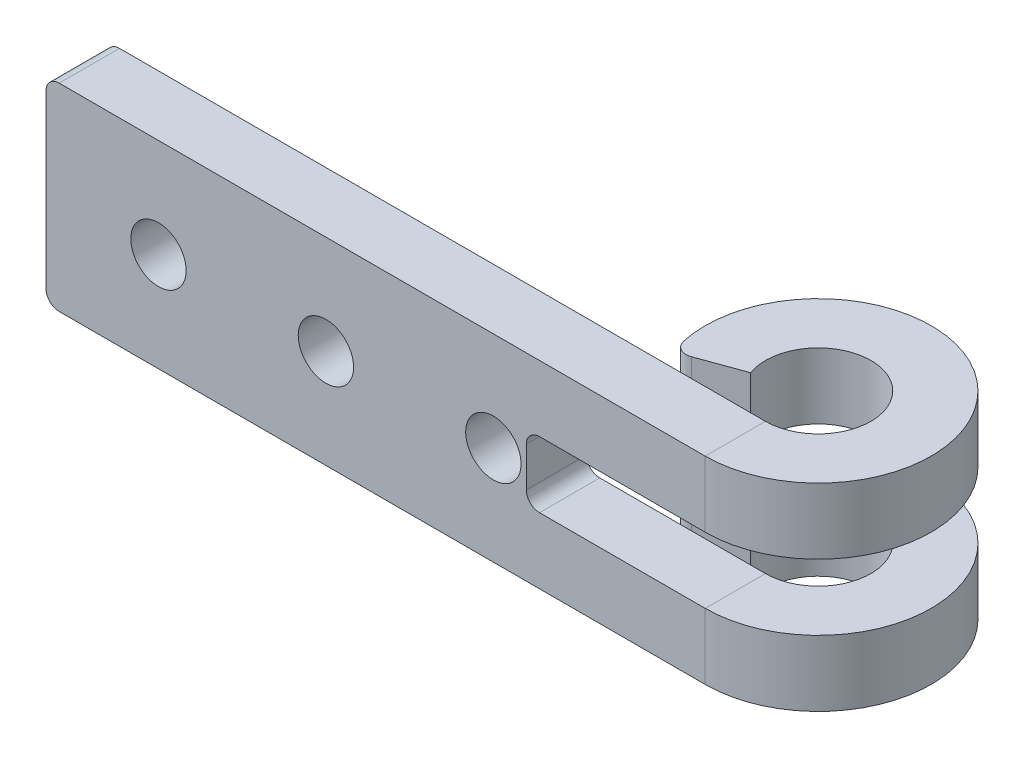
ISO-10303-21;
HEADER;
FILE_DESCRIPTION(('STEP AP214'),'2;1');
FILE_NAME('part.step','',(''),(''),'','','');
FILE_SCHEMA(('AUTOMOTIVE_DESIGN { 1 0 10303 214 1 1 1 1 }'));
ENDSEC;
DATA;
#1=APPLICATION_CONTEXT('core data for automotive mechanical design processes');
#2=APPLICATION_PROTOCOL_DEFINITION('international standard','automotive_design',2000,#1);
#3=PRODUCT_CONTEXT('',#1,'mechanical');
#4=PRODUCT('Part','Part','',(#3));
#5=PRODUCT_RELATED_PRODUCT_CATEGORY('part','',(#4));
#6=PRODUCT_DEFINITION_FORMATION('','',#4);
#7=PRODUCT_DEFINITION_CONTEXT('part definition',#1,'design');
#8=PRODUCT_DEFINITION('design','',#6,#7);
#9=PRODUCT_DEFINITION_SHAPE('','',#8);
#10=(LENGTH_UNIT() NAMED_UNIT(*) SI_UNIT(.MILLI.,.METRE.));
#11=(NAMED_UNIT(*) PLANE_ANGLE_UNIT() SI_UNIT($,.RADIAN.));
#12=(NAMED_UNIT(*) SI_UNIT($,.STERADIAN.) SOLID_ANGLE_UNIT());
#13=UNCERTAINTY_MEASURE_WITH_UNIT(LENGTH_MEASURE(1.E-05),#10,'distance_accuracy_value','');
#14=(GEOMETRIC_REPRESENTATION_CONTEXT(3) GLOBAL_UNCERTAINTY_ASSIGNED_CONTEXT((#13)) GLOBAL_UNIT_ASSIGNED_CONTEXT((#10,
#11,#12)) REPRESENTATION_CONTEXT('',''));
#15=CARTESIAN_POINT('',(0.,0.,0.));
#16=DIRECTION('',(0.,0.,1.));
#17=DIRECTION('',(1.,0.,0.));
#18=AXIS2_PLACEMENT_3D('',#15,#16,#17);
#19=CARTESIAN_POINT('',(58.57,10.,-14.));
#20=DIRECTION('',(0.,-1.,0.));
#21=DIRECTION('',(0.,0.,-1.));
#22=AXIS2_PLACEMENT_3D('',#19,#20,#21);
#23=PLANE('',#22);
#24=DIRECTION('',(-1.,0.,0.));
#25=VECTOR('',#24,1.);
#26=CARTESIAN_POINT('',(0.,10.,4.57));
#27=LINE('',#26,#25);
#28=CARTESIAN_POINT('',(50.,10.,4.57));
#29=VERTEX_POINT('',#28);
#30=CARTESIAN_POINT('',(37.43,10.,4.57));
#31=VERTEX_POINT('',#30);
#32=EDGE_CURVE('E213',#29,#31,#27,.T.);
#33=ORIENTED_EDGE('',*,*,#32,.T.);
#34=DIRECTION('',(0.,0.,1.));
#35=VECTOR('',#34,1.);
#36=CARTESIAN_POINT('',(37.43,10.,0.));
#37=LINE('',#36,#35);
#38=CARTESIAN_POINT('',(37.43,10.,0.));
#39=VERTEX_POINT('',#38);
#40=EDGE_CURVE('E263',#31,#39,#37,.F.);
#41=ORIENTED_EDGE('',*,*,#40,.T.);
#42=DIRECTION('',(-1.,0.,0.));
#43=VECTOR('',#42,1.);
#44=CARTESIAN_POINT('',(0.,10.,0.));
#45=LINE('',#44,#43);
#46=CARTESIAN_POINT('',(50.,10.,0.));
#47=VERTEX_POINT('',#46);
#48=EDGE_CURVE('E195',#47,#39,#45,.T.);
#49=ORIENTED_EDGE('',*,*,#48,.F.);
#50=DIRECTION('',(0.,0.,1.));
#51=VECTOR('',#50,1.);
#52=CARTESIAN_POINT('',(50.,10.,0.));
#53=LINE('',#52,#51);
#54=EDGE_CURVE('E190',#47,#29,#53,.T.);
#55=ORIENTED_EDGE('',*,*,#54,.T.);
#56=EDGE_LOOP('',(#33,#41,#49,#55));
#57=FACE_BOUND('',#56,.T.);
#58=ADVANCED_FACE('F47',(#57),#23,.T.);
#59=CARTESIAN_POINT('',(58.57,5.,-14.));
#60=DIRECTION('',(0.,1.,0.));
#61=DIRECTION('',(0.,0.,1.));
#62=AXIS2_PLACEMENT_3D('',#59,#60,#61);
#63=PLANE('',#62);
#64=DIRECTION('',(1.,0.,0.));
#65=VECTOR('',#64,1.);
#66=CARTESIAN_POINT('',(0.,5.,0.));
#67=LINE('',#66,#65);
#68=CARTESIAN_POINT('',(37.43,5.,0.));
#69=VERTEX_POINT('',#68);
#70=CARTESIAN_POINT('',(50.,5.,0.));
#71=VERTEX_POINT('',#70);
#72=EDGE_CURVE('E284',#69,#71,#67,.T.);
#73=ORIENTED_EDGE('',*,*,#72,.F.);
#74=DIRECTION('',(0.,0.,1.));
#75=VECTOR('',#74,1.);
#76=CARTESIAN_POINT('',(37.43,5.,4.57));
#77=LINE('',#76,#75);
#78=CARTESIAN_POINT('',(37.43,5.,4.57));
#79=VERTEX_POINT('',#78);
#80=EDGE_CURVE('E255',#69,#79,#77,.T.);
#81=ORIENTED_EDGE('',*,*,#80,.T.);
#82=DIRECTION('',(1.,0.,0.));
#83=VECTOR('',#82,1.);
#84=CARTESIAN_POINT('',(0.,5.,4.57));
#85=LINE('',#84,#83);
#86=CARTESIAN_POINT('',(50.,5.,4.57));
#87=VERTEX_POINT('',#86);
#88=EDGE_CURVE('E218',#79,#87,#85,.T.);
#89=ORIENTED_EDGE('',*,*,#88,.T.);
#90=DIRECTION('',(0.,0.,-1.));
#91=VECTOR('',#90,1.);
#92=CARTESIAN_POINT('',(50.,5.,4.57));
#93=LINE('',#92,#91);
#94=EDGE_CURVE('E220',#87,#71,#93,.T.);
#95=ORIENTED_EDGE('',*,*,#94,.T.);
#96=EDGE_LOOP('',(#73,#81,#89,#95));
#97=FACE_BOUND('',#96,.T.);
#98=ADVANCED_FACE('F387',(#97),#63,.T.);
#99=CARTESIAN_POINT('',(50.,15.,-4.));
#100=DIRECTION('',(0.,-1.,0.));
#101=DIRECTION('',(0.,0.,-1.));
#102=AXIS2_PLACEMENT_3D('',#99,#100,#101);
#103=CYLINDRICAL_SURFACE('',#102,8.57);
#104=DIRECTION('',(0.,-1.,0.));
#105=VECTOR('',#104,1.);
#106=CARTESIAN_POINT('',(41.630208292245,15.,-2.158401029324));
#107=LINE('',#106,#105);
#108=CARTESIAN_POINT('',(41.630208292245,0.,-2.158401029324));
#109=VERTEX_POINT('',#108);
#110=CARTESIAN_POINT('',(41.630208292245,5.,-2.158401029324));
#111=VERTEX_POINT('',#110);
#112=EDGE_CURVE('E236',#109,#111,#107,.F.);
#113=ORIENTED_EDGE('',*,*,#112,.T.);
#114=CARTESIAN_POINT('',(50.,5.,-4.));
#115=DIRECTION('',(0.,1.,0.));
#116=DIRECTION('',(0.,0.,1.));
#117=AXIS2_PLACEMENT_3D('',#114,#115,#116);
#118=CIRCLE('',#117,8.57);
#119=EDGE_CURVE('E269',#87,#111,#118,.T.);
#120=ORIENTED_EDGE('',*,*,#119,.F.);
#121=DIRECTION('',(0.,-1.,0.));
#122=VECTOR('',#121,1.);
#123=CARTESIAN_POINT('',(50.,15.,4.57));
#124=LINE('',#123,#122);
#125=CARTESIAN_POINT('',(50.,0.,4.57));
#126=VERTEX_POINT('',#125);
#127=EDGE_CURVE('E298',#87,#126,#124,.T.);
#128=ORIENTED_EDGE('',*,*,#127,.T.);
#129=CARTESIAN_POINT('',(50.,0.,-4.));
#130=DIRECTION('',(0.,1.,0.));
#131=DIRECTION('',(1.,0.,0.));
#132=AXIS2_PLACEMENT_3D('',#129,#130,#131);
#133=CIRCLE('',#132,8.57);
#134=EDGE_CURVE('E286',#126,#109,#133,.T.);
#135=ORIENTED_EDGE('',*,*,#134,.T.);
#136=EDGE_LOOP('',(#113,#120,#128,#135));
#137=FACE_BOUND('',#136,.T.);
#138=ADVANCED_FACE('F394',(#137),#103,.T.);
#139=CARTESIAN_POINT('',(50.,10.,-4.));
#140=DIRECTION('',(0.,-1.,0.));
#141=DIRECTION('',(0.,0.,-1.));
#142=AXIS2_PLACEMENT_3D('',#139,#140,#141);
#143=CIRCLE('',#142,8.57);
#144=CARTESIAN_POINT('',(41.630208292245,10.,-2.158401029324));
#145=VERTEX_POINT('',#144);
#146=EDGE_CURVE('E185',#145,#29,#143,.T.);
#147=ORIENTED_EDGE('',*,*,#146,.F.);
#148=DIRECTION('',(0.,-1.,0.));
#149=VECTOR('',#148,1.);
#150=CARTESIAN_POINT('',(41.630208292245,15.,-2.158401029324));
#151=LINE('',#150,#149);
#152=CARTESIAN_POINT('',(41.630208292245,15.,-2.158401029324));
#153=VERTEX_POINT('',#152);
#154=EDGE_CURVE('E227',#145,#153,#151,.F.);
#155=ORIENTED_EDGE('',*,*,#154,.T.);
#156=CARTESIAN_POINT('',(50.,15.,-4.));
#157=DIRECTION('',(0.,1.,0.));
#158=DIRECTION('',(1.,0.,0.));
#159=AXIS2_PLACEMENT_3D('',#156,#157,#158);
#160=CIRCLE('',#159,8.57);
#161=CARTESIAN_POINT('',(50.,15.,4.57));
#162=VERTEX_POINT('',#161);
#163=EDGE_CURVE('E287',#162,#153,#160,.T.);
#164=ORIENTED_EDGE('',*,*,#163,.F.);
#165=EDGE_CURVE('E310',#162,#29,#124,.T.);
#166=ORIENTED_EDGE('',*,*,#165,.T.);
#167=EDGE_LOOP('',(#147,#155,#164,#166));
#168=FACE_BOUND('',#167,.T.);
#169=ADVANCED_FACE('F339',(#168),#103,.T.);
#170=CARTESIAN_POINT('',(46.2412295168564,15.,-2.63191942669733));
#171=DIRECTION('',(0.342020143325666,0.,0.93969262078591));
#172=DIRECTION('',(0.93969262078591,0.,-0.342020143325666));
#173=AXIS2_PLACEMENT_3D('',#170,#171,#172);
#174=PLANE('',#173);
#175=DIRECTION('',(-0.93969262078591,0.,0.342020143325666));
#176=VECTOR('',#175,1.);
#177=CARTESIAN_POINT('',(46.2412295168564,5.,-2.63191942669733));
#178=LINE('',#177,#176);
#179=CARTESIAN_POINT('',(46.2412295168564,5.,-2.63191942669733));
#180=VERTEX_POINT('',#179);
#181=CARTESIAN_POINT('',(42.9488669078874,5.,-1.43359743662164));
#182=VERTEX_POINT('',#181);
#183=EDGE_CURVE('E272',#180,#182,#178,.T.);
#184=ORIENTED_EDGE('',*,*,#183,.T.);
#185=DIRECTION('',(0.,1.,0.));
#186=VECTOR('',#185,1.);
#187=CARTESIAN_POINT('',(42.9488669078874,0.,-1.43359743662164));
#188=LINE('',#187,#186);
#189=CARTESIAN_POINT('',(42.9488669078874,0.,-1.43359743662164));
#190=VERTEX_POINT('',#189);
#191=EDGE_CURVE('E231',#182,#190,#188,.F.);
#192=ORIENTED_EDGE('',*,*,#191,.T.);
#193=DIRECTION('',(-0.939692620785909,0.,0.342020143325666));
#194=VECTOR('',#193,1.);
#195=CARTESIAN_POINT('',(46.2412295168564,0.,-2.63191942669733));
#196=LINE('',#195,#194);
#197=CARTESIAN_POINT('',(46.2412295168564,0.,-2.63191942669733));
#198=VERTEX_POINT('',#197);
#199=EDGE_CURVE('E301',#198,#190,#196,.T.);
#200=ORIENTED_EDGE('',*,*,#199,.F.);
#201=DIRECTION('',(0.,-1.,0.));
#202=VECTOR('',#201,1.);
#203=CARTESIAN_POINT('',(46.2412295168564,15.,-2.63191942669733));
#204=LINE('',#203,#202);
#205=EDGE_CURVE('E202',#180,#198,#204,.T.);
#206=ORIENTED_EDGE('',*,*,#205,.F.);
#207=EDGE_LOOP('',(#184,#192,#200,#206));
#208=FACE_BOUND('',#207,.T.);
#209=ADVANCED_FACE('F433',(#208),#174,.T.);
#210=DIRECTION('',(-0.939692620785909,0.,0.342020143325666));
#211=VECTOR('',#210,1.);
#212=CARTESIAN_POINT('',(46.2412295168564,15.,-2.63191942669733));
#213=LINE('',#212,#211);
#214=CARTESIAN_POINT('',(46.2412295168564,15.,-2.63191942669733));
#215=VERTEX_POINT('',#214);
#216=CARTESIAN_POINT('',(42.9488669078874,15.,-1.43359743662164));
#217=VERTEX_POINT('',#216);
#218=EDGE_CURVE('E290',#215,#217,#213,.T.);
#219=ORIENTED_EDGE('',*,*,#218,.T.);
#220=DIRECTION('',(0.,1.,0.));
#221=VECTOR('',#220,1.);
#222=CARTESIAN_POINT('',(42.9488669078874,10.,-1.43359743662164));
#223=LINE('',#222,#221);
#224=CARTESIAN_POINT('',(42.9488669078874,10.,-1.43359743662164));
#225=VERTEX_POINT('',#224);
#226=EDGE_CURVE('E182',#217,#225,#223,.F.);
#227=ORIENTED_EDGE('',*,*,#226,.T.);
#228=DIRECTION('',(0.93969262078591,0.,-0.342020143325666));
#229=VECTOR('',#228,1.);
#230=CARTESIAN_POINT('',(46.2412295168564,10.,-2.63191942669733));
#231=LINE('',#230,#229);
#232=CARTESIAN_POINT('',(46.2412295168564,10.,-2.63191942669733));
#233=VERTEX_POINT('',#232);
#234=EDGE_CURVE('E174',#225,#233,#231,.T.);
#235=ORIENTED_EDGE('',*,*,#234,.T.);
#236=EDGE_CURVE('E179',#215,#233,#204,.T.);
#237=ORIENTED_EDGE('',*,*,#236,.F.);
#238=EDGE_LOOP('',(#219,#227,#235,#237));
#239=FACE_BOUND('',#238,.T.);
#240=ADVANCED_FACE('F177',(#239),#174,.T.);
#241=CARTESIAN_POINT('',(50.,15.,-4.));
#242=DIRECTION('',(0.,-1.,0.));
#243=DIRECTION('',(0.,0.,-1.));
#244=AXIS2_PLACEMENT_3D('',#241,#242,#243);
#245=CYLINDRICAL_SURFACE('',#244,4.);
#246=DIRECTION('',(0.,-1.,0.));
#247=VECTOR('',#246,1.);
#248=CARTESIAN_POINT('',(50.,15.,0.));
#249=LINE('',#248,#247);
#250=CARTESIAN_POINT('',(50.,0.,0.));
#251=VERTEX_POINT('',#250);
#252=EDGE_CURVE('E317',#71,#251,#249,.T.);
#253=ORIENTED_EDGE('',*,*,#252,.F.);
#254=CARTESIAN_POINT('',(50.,5.,-4.));
#255=DIRECTION('',(0.,1.,0.));
#256=DIRECTION('',(0.,0.,1.));
#257=AXIS2_PLACEMENT_3D('',#254,#255,#256);
#258=CIRCLE('',#257,4.);
#259=EDGE_CURVE('E281',#71,#180,#258,.T.);
#260=ORIENTED_EDGE('',*,*,#259,.T.);
#261=ORIENTED_EDGE('',*,*,#205,.T.);
#262=CARTESIAN_POINT('',(50.,0.,-4.));
#263=DIRECTION('',(0.,1.,0.));
#264=DIRECTION('',(0.,0.,1.));
#265=AXIS2_PLACEMENT_3D('',#262,#263,#264);
#266=CIRCLE('',#265,4.);
#267=EDGE_CURVE('E304',#251,#198,#266,.T.);
#268=ORIENTED_EDGE('',*,*,#267,.F.);
#269=EDGE_LOOP('',(#253,#260,#261,#268));
#270=FACE_BOUND('',#269,.T.);
#271=ADVANCED_FACE('F429',(#270),#245,.F.);
#272=ORIENTED_EDGE('',*,*,#236,.T.);
#273=CARTESIAN_POINT('',(50.,10.,-4.));
#274=DIRECTION('',(0.,-1.,0.));
#275=DIRECTION('',(0.,0.,-1.));
#276=AXIS2_PLACEMENT_3D('',#273,#274,#275);
#277=CIRCLE('',#276,4.);
#278=EDGE_CURVE('E184',#233,#47,#277,.T.);
#279=ORIENTED_EDGE('',*,*,#278,.T.);
#280=CARTESIAN_POINT('',(50.,15.,0.));
#281=VERTEX_POINT('',#280);
#282=EDGE_CURVE('E207',#281,#47,#249,.T.);
#283=ORIENTED_EDGE('',*,*,#282,.F.);
#284=CARTESIAN_POINT('',(50.,15.,-4.));
#285=DIRECTION('',(0.,1.,0.));
#286=DIRECTION('',(0.,0.,1.));
#287=AXIS2_PLACEMENT_3D('',#284,#285,#286);
#288=CIRCLE('',#287,4.);
#289=EDGE_CURVE('E200',#281,#215,#288,.T.);
#290=ORIENTED_EDGE('',*,*,#289,.T.);
#291=EDGE_LOOP('',(#272,#279,#283,#290));
#292=FACE_BOUND('',#291,.T.);
#293=ADVANCED_FACE('F198',(#292),#245,.F.);
#294=CARTESIAN_POINT('',(0.,15.,0.));
#295=DIRECTION('',(0.,0.,-1.));
#296=DIRECTION('',(-1.,0.,0.));
#297=AXIS2_PLACEMENT_3D('',#294,#295,#296);
#298=PLANE('',#297);
#299=CARTESIAN_POINT('',(8.53,7.5,0.));
#300=DIRECTION('',(0.,0.,-1.));
#301=DIRECTION('',(-1.,0.,0.));
#302=AXIS2_PLACEMENT_3D('',#299,#300,#301);
#303=CIRCLE('',#302,2.1);
#304=CARTESIAN_POINT('',(6.43000000000001,7.5,0.));
#305=VERTEX_POINT('',#304);
#306=EDGE_CURVE('E364',#305,#305,#303,.T.);
#307=ORIENTED_EDGE('',*,*,#306,.F.);
#308=EDGE_LOOP('',(#307));
#309=FACE_BOUND('',#308,.T.);
#310=CARTESIAN_POINT('',(21.23,7.5,0.));
#311=DIRECTION('',(0.,0.,-1.));
#312=DIRECTION('',(-1.,0.,0.));
#313=AXIS2_PLACEMENT_3D('',#310,#311,#312);
#314=CIRCLE('',#313,2.1);
#315=CARTESIAN_POINT('',(19.13,7.5,0.));
#316=VERTEX_POINT('',#315);
#317=EDGE_CURVE('E682',#316,#316,#314,.T.);
#318=ORIENTED_EDGE('',*,*,#317,.F.);
#319=EDGE_LOOP('',(#318));
#320=FACE_BOUND('',#319,.T.);
#321=CARTESIAN_POINT('',(33.93,7.5,0.));
#322=DIRECTION('',(0.,0.,-1.));
#323=DIRECTION('',(-1.,0.,0.));
#324=AXIS2_PLACEMENT_3D('',#321,#322,#323);
#325=CIRCLE('',#324,2.1);
#326=CARTESIAN_POINT('',(31.83,7.5,0.));
#327=VERTEX_POINT('',#326);
#328=EDGE_CURVE('E345',#327,#327,#325,.T.);
#329=ORIENTED_EDGE('',*,*,#328,.F.);
#330=EDGE_LOOP('',(#329));
#331=FACE_BOUND('',#330,.T.);
#332=DIRECTION('',(1.,0.,0.));
#333=VECTOR('',#332,1.);
#334=CARTESIAN_POINT('',(0.,0.,0.));
#335=LINE('',#334,#333);
#336=CARTESIAN_POINT('',(1.,0.,0.));
#337=VERTEX_POINT('',#336);
#338=EDGE_CURVE('E307',#337,#251,#335,.T.);
#339=ORIENTED_EDGE('',*,*,#338,.F.);
#340=CARTESIAN_POINT('',(1.,1.,0.));
#341=DIRECTION('',(0.,0.,-1.));
#342=DIRECTION('',(-1.,0.,0.));
#343=AXIS2_PLACEMENT_3D('',#340,#341,#342);
#344=CIRCLE('',#343,1.);
#345=CARTESIAN_POINT('',(0.,1.,0.));
#346=VERTEX_POINT('',#345);
#347=EDGE_CURVE('E243',#337,#346,#344,.T.);
#348=ORIENTED_EDGE('',*,*,#347,.T.);
#349=DIRECTION('',(0.,-1.,0.));
#350=VECTOR('',#349,1.);
#351=CARTESIAN_POINT('',(0.,15.,0.));
#352=LINE('',#351,#350);
#353=CARTESIAN_POINT('',(0.,14.,0.));
#354=VERTEX_POINT('',#353);
#355=EDGE_CURVE('E315',#354,#346,#352,.T.);
#356=ORIENTED_EDGE('',*,*,#355,.F.);
#357=CARTESIAN_POINT('',(1.,14.,0.));
#358=DIRECTION('',(0.,0.,-1.));
#359=DIRECTION('',(-1.,0.,0.));
#360=AXIS2_PLACEMENT_3D('',#357,#358,#359);
#361=CIRCLE('',#360,1.);
#362=CARTESIAN_POINT('',(1.,15.,0.));
#363=VERTEX_POINT('',#362);
#364=EDGE_CURVE('E240',#354,#363,#361,.T.);
#365=ORIENTED_EDGE('',*,*,#364,.T.);
#366=DIRECTION('',(1.,0.,0.));
#367=VECTOR('',#366,1.);
#368=CARTESIAN_POINT('',(0.,15.,0.));
#369=LINE('',#368,#367);
#370=EDGE_CURVE('E294',#363,#281,#369,.T.);
#371=ORIENTED_EDGE('',*,*,#370,.T.);
#372=ORIENTED_EDGE('',*,*,#282,.T.);
#373=ORIENTED_EDGE('',*,*,#48,.T.);
#374=CARTESIAN_POINT('',(37.43,9.,0.));
#375=DIRECTION('',(0.,0.,-1.));
#376=DIRECTION('',(-1.,0.,0.));
#377=AXIS2_PLACEMENT_3D('',#374,#375,#376);
#378=CIRCLE('',#377,1.);
#379=CARTESIAN_POINT('',(36.43,9.,0.));
#380=VERTEX_POINT('',#379);
#381=EDGE_CURVE('E12',#39,#380,#378,.F.);
#382=ORIENTED_EDGE('',*,*,#381,.T.);
#383=DIRECTION('',(0.,-1.,0.));
#384=VECTOR('',#383,1.);
#385=CARTESIAN_POINT('',(36.43,15.,0.));
#386=LINE('',#385,#384);
#387=CARTESIAN_POINT('',(36.43,6.,0.));
#388=VERTEX_POINT('',#387);
#389=EDGE_CURVE('E273',#380,#388,#386,.T.);
#390=ORIENTED_EDGE('',*,*,#389,.T.);
#391=CARTESIAN_POINT('',(37.43,6.,0.));
#392=DIRECTION('',(0.,0.,-1.));
#393=DIRECTION('',(-1.,0.,0.));
#394=AXIS2_PLACEMENT_3D('',#391,#392,#393);
#395=CIRCLE('',#394,1.);
#396=EDGE_CURVE('E350',#388,#69,#395,.F.);
#397=ORIENTED_EDGE('',*,*,#396,.T.);
#398=ORIENTED_EDGE('',*,*,#72,.T.);
#399=ORIENTED_EDGE('',*,*,#252,.T.);
#400=EDGE_LOOP('',(#339,#348,#356,#365,#371,#372,#373,#382,#390,#397,#398,#399));
#401=FACE_BOUND('',#400,.T.);
#402=ADVANCED_FACE('F327',(#309,#320,#331,#401),#298,.T.);
#403=CARTESIAN_POINT('',(0.,15.,4.57));
#404=DIRECTION('',(0.,0.,-1.));
#405=DIRECTION('',(-1.,0.,0.));
#406=AXIS2_PLACEMENT_3D('',#403,#404,#405);
#407=PLANE('',#406);
#408=CARTESIAN_POINT('',(8.53,7.5,4.57));
#409=DIRECTION('',(0.,0.,-1.));
#410=DIRECTION('',(-1.,0.,0.));
#411=AXIS2_PLACEMENT_3D('',#408,#409,#410);
#412=CIRCLE('',#411,2.1);
#413=CARTESIAN_POINT('',(6.43000000000001,7.5,4.57));
#414=VERTEX_POINT('',#413);
#415=EDGE_CURVE('E51',#414,#414,#412,.T.);
#416=ORIENTED_EDGE('',*,*,#415,.T.);
#417=EDGE_LOOP('',(#416));
#418=FACE_BOUND('',#417,.T.);
#419=CARTESIAN_POINT('',(21.23,7.5,4.57));
#420=DIRECTION('',(0.,0.,-1.));
#421=DIRECTION('',(-1.,0.,0.));
#422=AXIS2_PLACEMENT_3D('',#419,#420,#421);
#423=CIRCLE('',#422,2.1);
#424=CARTESIAN_POINT('',(19.13,7.5,4.57));
#425=VERTEX_POINT('',#424);
#426=EDGE_CURVE('E343',#425,#425,#423,.T.);
#427=ORIENTED_EDGE('',*,*,#426,.T.);
#428=EDGE_LOOP('',(#427));
#429=FACE_BOUND('',#428,.T.);
#430=CARTESIAN_POINT('',(33.93,7.5,4.57));
#431=DIRECTION('',(0.,0.,-1.));
#432=DIRECTION('',(-1.,0.,0.));
#433=AXIS2_PLACEMENT_3D('',#430,#431,#432);
#434=CIRCLE('',#433,2.1);
#435=CARTESIAN_POINT('',(31.83,7.5,4.57));
#436=VERTEX_POINT('',#435);
#437=EDGE_CURVE('E362',#436,#436,#434,.T.);
#438=ORIENTED_EDGE('',*,*,#437,.T.);
#439=EDGE_LOOP('',(#438));
#440=FACE_BOUND('',#439,.T.);
#441=DIRECTION('',(0.,-1.,0.));
#442=VECTOR('',#441,1.);
#443=CARTESIAN_POINT('',(0.,15.,4.57));
#444=LINE('',#443,#442);
#445=CARTESIAN_POINT('',(0.,14.,4.57));
#446=VERTEX_POINT('',#445);
#447=CARTESIAN_POINT('',(0.,1.,4.57));
#448=VERTEX_POINT('',#447);
#449=EDGE_CURVE('E313',#446,#448,#444,.T.);
#450=ORIENTED_EDGE('',*,*,#449,.T.);
#451=CARTESIAN_POINT('',(1.,1.,4.57));
#452=DIRECTION('',(0.,0.,-1.));
#453=DIRECTION('',(-1.,0.,0.));
#454=AXIS2_PLACEMENT_3D('',#451,#452,#453);
#455=CIRCLE('',#454,1.);
#456=CARTESIAN_POINT('',(1.,0.,4.57));
#457=VERTEX_POINT('',#456);
#458=EDGE_CURVE('E252',#448,#457,#455,.F.);
#459=ORIENTED_EDGE('',*,*,#458,.T.);
#460=DIRECTION('',(1.,0.,0.));
#461=VECTOR('',#460,1.);
#462=CARTESIAN_POINT('',(0.,0.,4.57));
#463=LINE('',#462,#461);
#464=EDGE_CURVE('E291',#457,#126,#463,.T.);
#465=ORIENTED_EDGE('',*,*,#464,.T.);
#466=ORIENTED_EDGE('',*,*,#127,.F.);
#467=ORIENTED_EDGE('',*,*,#88,.F.);
#468=CARTESIAN_POINT('',(37.43,6.,4.57));
#469=DIRECTION('',(0.,0.,-1.));
#470=DIRECTION('',(-1.,0.,0.));
#471=AXIS2_PLACEMENT_3D('',#468,#469,#470);
#472=CIRCLE('',#471,1.);
#473=CARTESIAN_POINT('',(36.43,6.,4.57));
#474=VERTEX_POINT('',#473);
#475=EDGE_CURVE('E265',#79,#474,#472,.T.);
#476=ORIENTED_EDGE('',*,*,#475,.T.);
#477=DIRECTION('',(0.,-1.,0.));
#478=VECTOR('',#477,1.);
#479=CARTESIAN_POINT('',(36.43,15.,4.57));
#480=LINE('',#479,#478);
#481=CARTESIAN_POINT('',(36.43,9.,4.57));
#482=VERTEX_POINT('',#481);
#483=EDGE_CURVE('E215',#482,#474,#480,.T.);
#484=ORIENTED_EDGE('',*,*,#483,.F.);
#485=CARTESIAN_POINT('',(37.43,9.,4.57));
#486=DIRECTION('',(0.,0.,-1.));
#487=DIRECTION('',(-1.,0.,0.));
#488=AXIS2_PLACEMENT_3D('',#485,#486,#487);
#489=CIRCLE('',#488,1.);
#490=EDGE_CURVE('E56',#482,#31,#489,.T.);
#491=ORIENTED_EDGE('',*,*,#490,.T.);
#492=ORIENTED_EDGE('',*,*,#32,.F.);
#493=ORIENTED_EDGE('',*,*,#165,.F.);
#494=DIRECTION('',(1.,0.,0.));
#495=VECTOR('',#494,1.);
#496=CARTESIAN_POINT('',(0.,15.,4.57));
#497=LINE('',#496,#495);
#498=CARTESIAN_POINT('',(1.,15.,4.57));
#499=VERTEX_POINT('',#498);
#500=EDGE_CURVE('E296',#499,#162,#497,.T.);
#501=ORIENTED_EDGE('',*,*,#500,.F.);
#502=CARTESIAN_POINT('',(1.,14.,4.57));
#503=DIRECTION('',(0.,0.,-1.));
#504=DIRECTION('',(-1.,0.,0.));
#505=AXIS2_PLACEMENT_3D('',#502,#503,#504);
#506=CIRCLE('',#505,1.);
#507=EDGE_CURVE('E250',#499,#446,#506,.F.);
#508=ORIENTED_EDGE('',*,*,#507,.T.);
#509=EDGE_LOOP('',(#450,#459,#465,#466,#467,#476,#484,#491,#492,#493,#501,#508));
#510=FACE_BOUND('',#509,.T.);
#511=ADVANCED_FACE('F368',(#418,#429,#440,#510),#407,.F.);
#512=CARTESIAN_POINT('',(50.,15.,4.57));
#513=DIRECTION('',(0.,1.,0.));
#514=DIRECTION('',(0.,0.,1.));
#515=AXIS2_PLACEMENT_3D('',#512,#513,#514);
#516=PLANE('',#515);
#517=ORIENTED_EDGE('',*,*,#163,.T.);
#518=CARTESIAN_POINT('',(42.6068467645618,15.,-2.37329005740755));
#519=DIRECTION('',(0.,1.,0.));
#520=DIRECTION('',(0.,0.,1.));
#521=AXIS2_PLACEMENT_3D('',#518,#519,#520);
#522=CIRCLE('',#521,1.);
#523=EDGE_CURVE('E229',#153,#217,#522,.T.);
#524=ORIENTED_EDGE('',*,*,#523,.T.);
#525=ORIENTED_EDGE('',*,*,#218,.F.);
#526=ORIENTED_EDGE('',*,*,#289,.F.);
#527=DIRECTION('',(0.,0.,-1.));
#528=VECTOR('',#527,1.);
#529=CARTESIAN_POINT('',(50.,15.,4.57));
#530=LINE('',#529,#528);
#531=EDGE_CURVE('E205',#162,#281,#530,.T.);
#532=ORIENTED_EDGE('',*,*,#531,.F.);
#533=EDGE_LOOP('',(#517,#524,#525,#526,#532));
#534=FACE_BOUND('',#533,.T.);
#535=ADVANCED_FACE('F331',(#534),#516,.T.);
#536=CARTESIAN_POINT('',(50.,0.,0.));
#537=DIRECTION('',(0.,-1.,0.));
#538=DIRECTION('',(0.,0.,-1.));
#539=AXIS2_PLACEMENT_3D('',#536,#537,#538);
#540=PLANE('',#539);
#541=ORIENTED_EDGE('',*,*,#199,.T.);
#542=CARTESIAN_POINT('',(42.6068467645618,0.,-2.37329005740755));
#543=DIRECTION('',(0.,-1.,0.));
#544=DIRECTION('',(0.,0.,-1.));
#545=AXIS2_PLACEMENT_3D('',#542,#543,#544);
#546=CIRCLE('',#545,1.);
#547=EDGE_CURVE('E234',#190,#109,#546,.T.);
#548=ORIENTED_EDGE('',*,*,#547,.T.);
#549=ORIENTED_EDGE('',*,*,#134,.F.);
#550=DIRECTION('',(0.,0.,1.));
#551=VECTOR('',#550,1.);
#552=CARTESIAN_POINT('',(50.,0.,0.));
#553=LINE('',#552,#551);
#554=EDGE_CURVE('E201',#251,#126,#553,.T.);
#555=ORIENTED_EDGE('',*,*,#554,.F.);
#556=ORIENTED_EDGE('',*,*,#267,.T.);
#557=EDGE_LOOP('',(#541,#548,#549,#555,#556));
#558=FACE_BOUND('',#557,.T.);
#559=ADVANCED_FACE('F425',(#558),#540,.T.);
#560=CARTESIAN_POINT('',(0.,15.,4.57));
#561=DIRECTION('',(-1.,0.,0.));
#562=DIRECTION('',(0.,0.,1.));
#563=AXIS2_PLACEMENT_3D('',#560,#561,#562);
#564=PLANE('',#563);
#565=ORIENTED_EDGE('',*,*,#355,.T.);
#566=DIRECTION('',(0.,0.,-1.));
#567=VECTOR('',#566,1.);
#568=CARTESIAN_POINT('',(0.,1.,4.57));
#569=LINE('',#568,#567);
#570=EDGE_CURVE('E248',#346,#448,#569,.F.);
#571=ORIENTED_EDGE('',*,*,#570,.T.);
#572=ORIENTED_EDGE('',*,*,#449,.F.);
#573=DIRECTION('',(0.,0.,-1.));
#574=VECTOR('',#573,1.);
#575=CARTESIAN_POINT('',(0.,14.,4.57));
#576=LINE('',#575,#574);
#577=EDGE_CURVE('E245',#446,#354,#576,.T.);
#578=ORIENTED_EDGE('',*,*,#577,.T.);
#579=EDGE_LOOP('',(#565,#571,#572,#578));
#580=FACE_BOUND('',#579,.T.);
#581=ADVANCED_FACE('F416',(#580),#564,.T.);
#582=CARTESIAN_POINT('',(50.,15.,-4.));
#583=DIRECTION('',(0.,1.,0.));
#584=DIRECTION('',(1.,0.,0.));
#585=AXIS2_PLACEMENT_3D('',#582,#583,#584);
#586=PLANE('',#585);
#587=ORIENTED_EDGE('',*,*,#370,.F.);
#588=DIRECTION('',(0.,0.,-1.));
#589=VECTOR('',#588,1.);
#590=CARTESIAN_POINT('',(1.,15.,-4.));
#591=LINE('',#590,#589);
#592=EDGE_CURVE('E64',#363,#499,#591,.F.);
#593=ORIENTED_EDGE('',*,*,#592,.T.);
#594=ORIENTED_EDGE('',*,*,#500,.T.);
#595=ORIENTED_EDGE('',*,*,#531,.T.);
#596=EDGE_LOOP('',(#587,#593,#594,#595));
#597=FACE_BOUND('',#596,.T.);
#598=ADVANCED_FACE('F413',(#597),#586,.T.);
#599=CARTESIAN_POINT('',(50.,0.,-4.));
#600=DIRECTION('',(0.,1.,0.));
#601=DIRECTION('',(1.,0.,0.));
#602=AXIS2_PLACEMENT_3D('',#599,#600,#601);
#603=PLANE('',#602);
#604=ORIENTED_EDGE('',*,*,#464,.F.);
#605=DIRECTION('',(0.,0.,-1.));
#606=VECTOR('',#605,1.);
#607=CARTESIAN_POINT('',(1.,0.,0.));
#608=LINE('',#607,#606);
#609=EDGE_CURVE('E237',#457,#337,#608,.T.);
#610=ORIENTED_EDGE('',*,*,#609,.T.);
#611=ORIENTED_EDGE('',*,*,#338,.T.);
#612=ORIENTED_EDGE('',*,*,#554,.T.);
#613=EDGE_LOOP('',(#604,#610,#611,#612));
#614=FACE_BOUND('',#613,.T.);
#615=ADVANCED_FACE('F410',(#614),#603,.F.);
#616=ORIENTED_EDGE('',*,*,#119,.T.);
#617=CARTESIAN_POINT('',(42.6068467645618,5.,-2.37329005740755));
#618=DIRECTION('',(0.,1.,0.));
#619=DIRECTION('',(0.,0.,1.));
#620=AXIS2_PLACEMENT_3D('',#617,#618,#619);
#621=CIRCLE('',#620,1.);
#622=EDGE_CURVE('E241',#111,#182,#621,.T.);
#623=ORIENTED_EDGE('',*,*,#622,.T.);
#624=ORIENTED_EDGE('',*,*,#183,.F.);
#625=ORIENTED_EDGE('',*,*,#259,.F.);
#626=ORIENTED_EDGE('',*,*,#94,.F.);
#627=EDGE_LOOP('',(#616,#623,#624,#625,#626));
#628=FACE_BOUND('',#627,.T.);
#629=ADVANCED_FACE('F397',(#628),#63,.T.);
#630=CARTESIAN_POINT('',(36.43,10.,-14.));
#631=DIRECTION('',(1.,0.,0.));
#632=DIRECTION('',(0.,0.,-1.));
#633=AXIS2_PLACEMENT_3D('',#630,#631,#632);
#634=PLANE('',#633);
#635=ORIENTED_EDGE('',*,*,#483,.T.);
#636=DIRECTION('',(0.,0.,1.));
#637=VECTOR('',#636,1.);
#638=CARTESIAN_POINT('',(36.43,6.,0.));
#639=LINE('',#638,#637);
#640=EDGE_CURVE('E261',#474,#388,#639,.F.);
#641=ORIENTED_EDGE('',*,*,#640,.T.);
#642=ORIENTED_EDGE('',*,*,#389,.F.);
#643=DIRECTION('',(0.,0.,1.));
#644=VECTOR('',#643,1.);
#645=CARTESIAN_POINT('',(36.43,9.,4.57));
#646=LINE('',#645,#644);
#647=EDGE_CURVE('E258',#380,#482,#646,.T.);
#648=ORIENTED_EDGE('',*,*,#647,.T.);
#649=EDGE_LOOP('',(#635,#641,#642,#648));
#650=FACE_BOUND('',#649,.T.);
#651=ADVANCED_FACE('F400',(#650),#634,.T.);
#652=ORIENTED_EDGE('',*,*,#234,.F.);
#653=CARTESIAN_POINT('',(42.6068467645618,10.,-2.37329005740755));
#654=DIRECTION('',(0.,-1.,0.));
#655=DIRECTION('',(0.,0.,-1.));
#656=AXIS2_PLACEMENT_3D('',#653,#654,#655);
#657=CIRCLE('',#656,1.);
#658=EDGE_CURVE('E225',#225,#145,#657,.T.);
#659=ORIENTED_EDGE('',*,*,#658,.T.);
#660=ORIENTED_EDGE('',*,*,#146,.T.);
#661=ORIENTED_EDGE('',*,*,#54,.F.);
#662=ORIENTED_EDGE('',*,*,#278,.F.);
#663=EDGE_LOOP('',(#652,#659,#660,#661,#662));
#664=FACE_BOUND('',#663,.T.);
#665=ADVANCED_FACE('F188',(#664),#23,.T.);
#666=CARTESIAN_POINT('',(42.6068467645618,15.,-2.37329005740755));
#667=DIRECTION('',(0.,-1.,0.));
#668=DIRECTION('',(0.,0.,-1.));
#669=AXIS2_PLACEMENT_3D('',#666,#667,#668);
#670=CYLINDRICAL_SURFACE('',#669,1.);
#671=ORIENTED_EDGE('',*,*,#523,.F.);
#672=ORIENTED_EDGE('',*,*,#154,.F.);
#673=ORIENTED_EDGE('',*,*,#658,.F.);
#674=ORIENTED_EDGE('',*,*,#226,.F.);
#675=EDGE_LOOP('',(#671,#672,#673,#674));
#676=FACE_BOUND('',#675,.T.);
#677=ADVANCED_FACE('F335',(#676),#670,.T.);
#678=CARTESIAN_POINT('',(42.6068467645618,15.,-2.37329005740755));
#679=DIRECTION('',(0.,-1.,0.));
#680=DIRECTION('',(0.,0.,-1.));
#681=AXIS2_PLACEMENT_3D('',#678,#679,#680);
#682=CYLINDRICAL_SURFACE('',#681,1.);
#683=ORIENTED_EDGE('',*,*,#622,.F.);
#684=ORIENTED_EDGE('',*,*,#112,.F.);
#685=ORIENTED_EDGE('',*,*,#547,.F.);
#686=ORIENTED_EDGE('',*,*,#191,.F.);
#687=EDGE_LOOP('',(#683,#684,#685,#686));
#688=FACE_BOUND('',#687,.T.);
#689=ADVANCED_FACE('F405',(#688),#682,.T.);
#690=CARTESIAN_POINT('',(1.,1.,-4.));
#691=DIRECTION('',(0.,0.,1.));
#692=DIRECTION('',(1.,0.,0.));
#693=AXIS2_PLACEMENT_3D('',#690,#691,#692);
#694=CYLINDRICAL_SURFACE('',#693,1.);
#695=ORIENTED_EDGE('',*,*,#458,.F.);
#696=ORIENTED_EDGE('',*,*,#570,.F.);
#697=ORIENTED_EDGE('',*,*,#347,.F.);
#698=ORIENTED_EDGE('',*,*,#609,.F.);
#699=EDGE_LOOP('',(#695,#696,#697,#698));
#700=FACE_BOUND('',#699,.T.);
#701=ADVANCED_FACE('F447',(#700),#694,.T.);
#702=CARTESIAN_POINT('',(1.,14.,4.57));
#703=DIRECTION('',(0.,0.,-1.));
#704=DIRECTION('',(-1.,0.,0.));
#705=AXIS2_PLACEMENT_3D('',#702,#703,#704);
#706=CYLINDRICAL_SURFACE('',#705,1.);
#707=ORIENTED_EDGE('',*,*,#507,.F.);
#708=ORIENTED_EDGE('',*,*,#592,.F.);
#709=ORIENTED_EDGE('',*,*,#364,.F.);
#710=ORIENTED_EDGE('',*,*,#577,.F.);
#711=EDGE_LOOP('',(#707,#708,#709,#710));
#712=FACE_BOUND('',#711,.T.);
#713=ADVANCED_FACE('F451',(#712),#706,.T.);
#714=CARTESIAN_POINT('',(37.43,6.,-14.));
#715=DIRECTION('',(0.,0.,-1.));
#716=DIRECTION('',(-1.,0.,0.));
#717=AXIS2_PLACEMENT_3D('',#714,#715,#716);
#718=CYLINDRICAL_SURFACE('',#717,1.);
#719=ORIENTED_EDGE('',*,*,#396,.F.);
#720=ORIENTED_EDGE('',*,*,#640,.F.);
#721=ORIENTED_EDGE('',*,*,#475,.F.);
#722=ORIENTED_EDGE('',*,*,#80,.F.);
#723=EDGE_LOOP('',(#719,#720,#721,#722));
#724=FACE_BOUND('',#723,.T.);
#725=ADVANCED_FACE('F357',(#724),#718,.F.);
#726=CARTESIAN_POINT('',(37.43,9.,-14.));
#727=DIRECTION('',(0.,0.,-1.));
#728=DIRECTION('',(-1.,0.,0.));
#729=AXIS2_PLACEMENT_3D('',#726,#727,#728);
#730=CYLINDRICAL_SURFACE('',#729,1.);
#731=ORIENTED_EDGE('',*,*,#381,.F.);
#732=ORIENTED_EDGE('',*,*,#40,.F.);
#733=ORIENTED_EDGE('',*,*,#490,.F.);
#734=ORIENTED_EDGE('',*,*,#647,.F.);
#735=EDGE_LOOP('',(#731,#732,#733,#734));
#736=FACE_BOUND('',#735,.T.);
#737=ADVANCED_FACE('F49',(#736),#730,.F.);
#738=CARTESIAN_POINT('',(33.93,7.5,10.));
#739=DIRECTION('',(0.,0.,-1.));
#740=DIRECTION('',(-1.,0.,0.));
#741=AXIS2_PLACEMENT_3D('',#738,#739,#740);
#742=CYLINDRICAL_SURFACE('',#741,2.1);
#743=ORIENTED_EDGE('',*,*,#328,.T.);
#744=EDGE_LOOP('',(#743));
#745=FACE_BOUND('',#744,.T.);
#746=ORIENTED_EDGE('',*,*,#437,.F.);
#747=EDGE_LOOP('',(#746));
#748=FACE_BOUND('',#747,.T.);
#749=ADVANCED_FACE('F374',(#745,#748),#742,.F.);
#750=CARTESIAN_POINT('',(21.23,7.5,10.));
#751=DIRECTION('',(0.,0.,-1.));
#752=DIRECTION('',(-1.,0.,0.));
#753=AXIS2_PLACEMENT_3D('',#750,#751,#752);
#754=CYLINDRICAL_SURFACE('',#753,2.1);
#755=ORIENTED_EDGE('',*,*,#317,.T.);
#756=EDGE_LOOP('',(#755));
#757=FACE_BOUND('',#756,.T.);
#758=ORIENTED_EDGE('',*,*,#426,.F.);
#759=EDGE_LOOP('',(#758));
#760=FACE_BOUND('',#759,.T.);
#761=ADVANCED_FACE('F371',(#757,#760),#754,.F.);
#762=CARTESIAN_POINT('',(8.53,7.5,10.));
#763=DIRECTION('',(0.,0.,-1.));
#764=DIRECTION('',(-1.,0.,0.));
#765=AXIS2_PLACEMENT_3D('',#762,#763,#764);
#766=CYLINDRICAL_SURFACE('',#765,2.1);
#767=ORIENTED_EDGE('',*,*,#306,.T.);
#768=EDGE_LOOP('',(#767));
#769=FACE_BOUND('',#768,.T.);
#770=ORIENTED_EDGE('',*,*,#415,.F.);
#771=EDGE_LOOP('',(#770));
#772=FACE_BOUND('',#771,.T.);
#773=ADVANCED_FACE('F373',(#769,#772),#766,.F.);
#774=CLOSED_SHELL('',(#58,#98,#138,#169,#209,#240,#271,#293,#402,#511,#535,#559,#581,#598,#615,
#629,#651,#665,#677,#689,#701,#713,#725,#737,#749,#761,#773));
#775=MANIFOLD_SOLID_BREP('B2',#774);
#776=ADVANCED_BREP_SHAPE_REPRESENTATION('',(#18,#775),#14);
#777=SHAPE_DEFINITION_REPRESENTATION(#9,#776);
ENDSEC;
END-ISO-10303-21;
